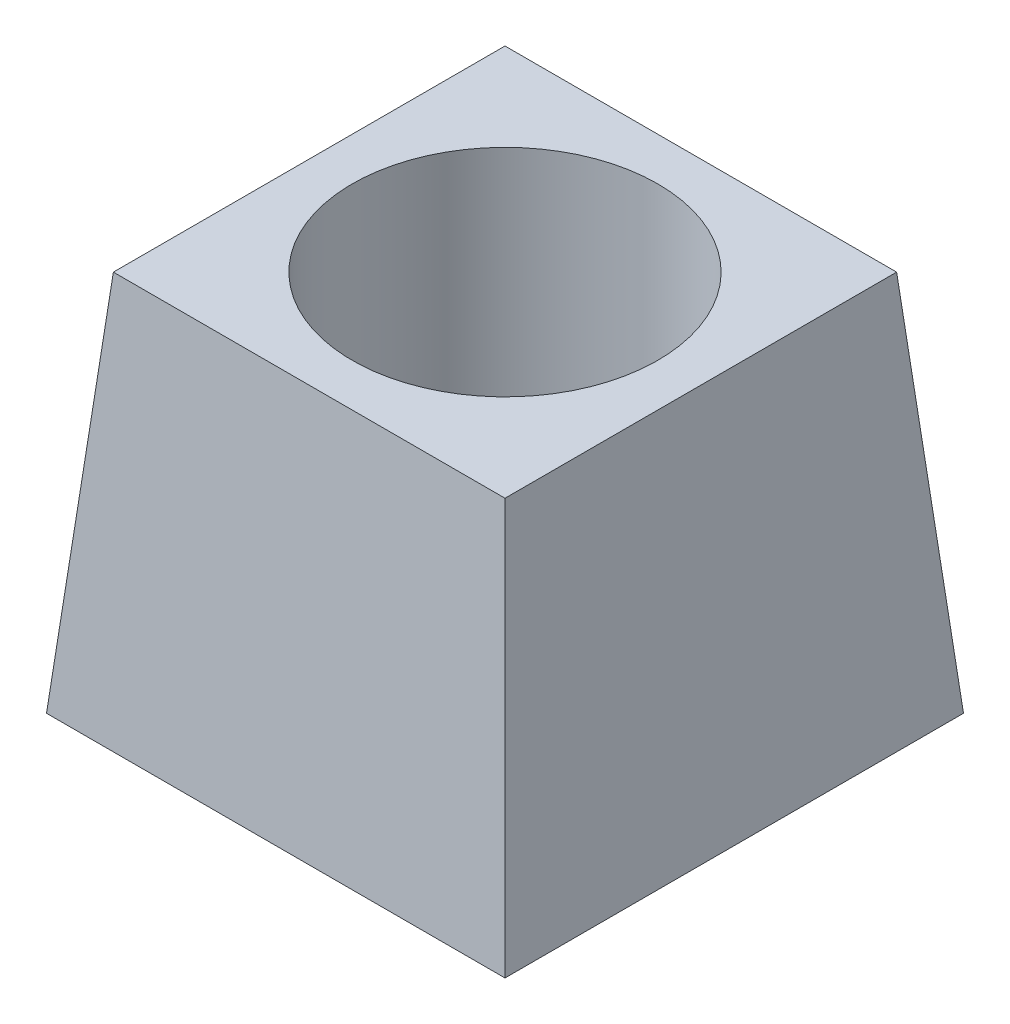
ISO-10303-21;
HEADER;
FILE_DESCRIPTION(('STEP AP214'),'2;1');
FILE_NAME('part.step','',(''),(''),'','','');
FILE_SCHEMA(('AUTOMOTIVE_DESIGN { 1 0 10303 214 1 1 1 1 }'));
ENDSEC;
DATA;
#1=APPLICATION_CONTEXT('core data for automotive mechanical design processes');
#2=APPLICATION_PROTOCOL_DEFINITION('international standard','automotive_design',2000,#1);
#3=PRODUCT_CONTEXT('',#1,'mechanical');
#4=PRODUCT('Part','Part','',(#3));
#5=PRODUCT_RELATED_PRODUCT_CATEGORY('part','',(#4));
#6=PRODUCT_DEFINITION_FORMATION('','',#4);
#7=PRODUCT_DEFINITION_CONTEXT('part definition',#1,'design');
#8=PRODUCT_DEFINITION('design','',#6,#7);
#9=PRODUCT_DEFINITION_SHAPE('','',#8);
#10=(LENGTH_UNIT() NAMED_UNIT(*) SI_UNIT(.MILLI.,.METRE.));
#11=(NAMED_UNIT(*) PLANE_ANGLE_UNIT() SI_UNIT($,.RADIAN.));
#12=(NAMED_UNIT(*) SI_UNIT($,.STERADIAN.) SOLID_ANGLE_UNIT());
#13=UNCERTAINTY_MEASURE_WITH_UNIT(LENGTH_MEASURE(1.E-05),#10,'distance_accuracy_value','');
#14=(GEOMETRIC_REPRESENTATION_CONTEXT(3) GLOBAL_UNCERTAINTY_ASSIGNED_CONTEXT((#13)) GLOBAL_UNIT_ASSIGNED_CONTEXT((#10,
#11,#12)) REPRESENTATION_CONTEXT('',''));
#15=CARTESIAN_POINT('',(0.,0.,0.));
#16=DIRECTION('',(0.,0.,1.));
#17=DIRECTION('',(1.,0.,0.));
#18=AXIS2_PLACEMENT_3D('',#15,#16,#17);
#19=CARTESIAN_POINT('',(0.,0.,0.));
#20=DIRECTION('',(-0.996194698091746,0.0871557427476582,0.));
#21=DIRECTION('',(-0.0871557427476582,-0.996194698091746,0.));
#22=AXIS2_PLACEMENT_3D('',#19,#20,#21);
#23=PLANE('',#22);
#24=DIRECTION('',(0.,0.,1.));
#25=VECTOR('',#24,1.);
#26=CARTESIAN_POINT('',(0.,0.,0.));
#27=LINE('',#26,#25);
#28=CARTESIAN_POINT('',(0.,0.,-30.));
#29=VERTEX_POINT('',#28);
#30=CARTESIAN_POINT('',(0.,0.,0.));
#31=VERTEX_POINT('',#30);
#32=EDGE_CURVE('E79',#29,#31,#27,.T.);
#33=ORIENTED_EDGE('',*,*,#32,.T.);
#34=DIRECTION('',(-0.0868265938642476,-0.992432509138967,0.0868265938642476));
#35=VECTOR('',#34,1.);
#36=CARTESIAN_POINT('',(0.,0.,0.));
#37=LINE('',#36,#35);
#38=CARTESIAN_POINT('',(2.1872165881481,25.,-2.1872165881481));
#39=VERTEX_POINT('',#38);
#40=EDGE_CURVE('E11',#39,#31,#37,.T.);
#41=ORIENTED_EDGE('',*,*,#40,.F.);
#42=DIRECTION('',(0.,0.,-1.));
#43=VECTOR('',#42,1.);
#44=CARTESIAN_POINT('',(2.1872165881481,25.,-30.));
#45=LINE('',#44,#43);
#46=CARTESIAN_POINT('',(2.1872165881481,25.,-27.8127834118519));
#47=VERTEX_POINT('',#46);
#48=EDGE_CURVE('E100',#47,#39,#45,.F.);
#49=ORIENTED_EDGE('',*,*,#48,.F.);
#50=DIRECTION('',(-0.0868265938642476,-0.992432509138967,-0.0868265938642476));
#51=VECTOR('',#50,1.);
#52=CARTESIAN_POINT('',(0.22616572206201,2.58508603226056,-29.773834277938));
#53=LINE('',#52,#51);
#54=EDGE_CURVE('E90',#47,#29,#53,.T.);
#55=ORIENTED_EDGE('',*,*,#54,.T.);
#56=EDGE_LOOP('',(#33,#41,#49,#55));
#57=FACE_BOUND('',#56,.T.);
#58=ADVANCED_FACE('F33',(#57),#23,.T.);
#59=CARTESIAN_POINT('',(0.,0.,0.));
#60=DIRECTION('',(0.,0.0871557427476582,0.996194698091746));
#61=DIRECTION('',(0.,-0.996194698091746,0.0871557427476582));
#62=AXIS2_PLACEMENT_3D('',#59,#60,#61);
#63=PLANE('',#62);
#64=DIRECTION('',(1.,0.,0.));
#65=VECTOR('',#64,1.);
#66=CARTESIAN_POINT('',(0.,0.,0.));
#67=LINE('',#66,#65);
#68=CARTESIAN_POINT('',(30.,0.,0.));
#69=VERTEX_POINT('',#68);
#70=EDGE_CURVE('E75',#31,#69,#67,.T.);
#71=ORIENTED_EDGE('',*,*,#70,.T.);
#72=DIRECTION('',(0.0868265938642476,-0.992432509138967,0.0868265938642476));
#73=VECTOR('',#72,1.);
#74=CARTESIAN_POINT('',(30.,0.,0.));
#75=LINE('',#74,#73);
#76=CARTESIAN_POINT('',(27.8127834118519,25.,-2.1872165881481));
#77=VERTEX_POINT('',#76);
#78=EDGE_CURVE('E42',#77,#69,#75,.T.);
#79=ORIENTED_EDGE('',*,*,#78,.F.);
#80=DIRECTION('',(-1.,0.,0.));
#81=VECTOR('',#80,1.);
#82=CARTESIAN_POINT('',(0.,25.,-2.1872165881481));
#83=LINE('',#82,#81);
#84=EDGE_CURVE('E86',#39,#77,#83,.F.);
#85=ORIENTED_EDGE('',*,*,#84,.F.);
#86=ORIENTED_EDGE('',*,*,#40,.T.);
#87=EDGE_LOOP('',(#71,#79,#85,#86));
#88=FACE_BOUND('',#87,.T.);
#89=ADVANCED_FACE('F35',(#88),#63,.T.);
#90=CARTESIAN_POINT('',(30.,0.,0.));
#91=DIRECTION('',(0.996194698091746,0.0871557427476582,0.));
#92=DIRECTION('',(-0.0871557427476582,0.996194698091746,0.));
#93=AXIS2_PLACEMENT_3D('',#90,#91,#92);
#94=PLANE('',#93);
#95=DIRECTION('',(0.,0.,-1.));
#96=VECTOR('',#95,1.);
#97=CARTESIAN_POINT('',(30.,0.,0.));
#98=LINE('',#97,#96);
#99=CARTESIAN_POINT('',(30.,0.,-30.));
#100=VERTEX_POINT('',#99);
#101=EDGE_CURVE('E80',#69,#100,#98,.T.);
#102=ORIENTED_EDGE('',*,*,#101,.T.);
#103=DIRECTION('',(0.0868265938642476,-0.992432509138967,-0.0868265938642476));
#104=VECTOR('',#103,1.);
#105=CARTESIAN_POINT('',(29.773834277938,2.58508603226056,-29.773834277938));
#106=LINE('',#105,#104);
#107=CARTESIAN_POINT('',(27.8127834118519,25.,-27.8127834118519));
#108=VERTEX_POINT('',#107);
#109=EDGE_CURVE('E103',#108,#100,#106,.T.);
#110=ORIENTED_EDGE('',*,*,#109,.F.);
#111=DIRECTION('',(0.,0.,1.));
#112=VECTOR('',#111,1.);
#113=CARTESIAN_POINT('',(27.8127834118519,25.,-30.));
#114=LINE('',#113,#112);
#115=EDGE_CURVE('E54',#77,#108,#114,.F.);
#116=ORIENTED_EDGE('',*,*,#115,.F.);
#117=ORIENTED_EDGE('',*,*,#78,.T.);
#118=EDGE_LOOP('',(#102,#110,#116,#117));
#119=FACE_BOUND('',#118,.T.);
#120=ADVANCED_FACE('F110',(#119),#94,.T.);
#121=CARTESIAN_POINT('',(0.,0.,-30.));
#122=DIRECTION('',(0.,0.0871557427476582,-0.996194698091746));
#123=DIRECTION('',(0.,0.996194698091746,0.0871557427476582));
#124=AXIS2_PLACEMENT_3D('',#121,#122,#123);
#125=PLANE('',#124);
#126=DIRECTION('',(-1.,0.,0.));
#127=VECTOR('',#126,1.);
#128=CARTESIAN_POINT('',(0.,0.,-30.));
#129=LINE('',#128,#127);
#130=EDGE_CURVE('E99',#100,#29,#129,.T.);
#131=ORIENTED_EDGE('',*,*,#130,.T.);
#132=ORIENTED_EDGE('',*,*,#54,.F.);
#133=DIRECTION('',(1.,0.,0.));
#134=VECTOR('',#133,1.);
#135=CARTESIAN_POINT('',(0.,25.,-27.8127834118519));
#136=LINE('',#135,#134);
#137=EDGE_CURVE('E37',#108,#47,#136,.F.);
#138=ORIENTED_EDGE('',*,*,#137,.F.);
#139=ORIENTED_EDGE('',*,*,#109,.T.);
#140=EDGE_LOOP('',(#131,#132,#138,#139));
#141=FACE_BOUND('',#140,.T.);
#142=ADVANCED_FACE('F112',(#141),#125,.T.);
#143=CARTESIAN_POINT('',(0.,25.,-30.));
#144=DIRECTION('',(0.,-1.,0.));
#145=DIRECTION('',(0.,0.,-1.));
#146=AXIS2_PLACEMENT_3D('',#143,#144,#145);
#147=PLANE('',#146);
#148=CARTESIAN_POINT('',(15.,25.,-15.));
#149=DIRECTION('',(0.,-1.,0.));
#150=DIRECTION('',(0.,0.,-1.));
#151=AXIS2_PLACEMENT_3D('',#148,#149,#150);
#152=CIRCLE('',#151,10.);
#153=CARTESIAN_POINT('',(15.,25.,-25.));
#154=VERTEX_POINT('',#153);
#155=EDGE_CURVE('E91',#154,#154,#152,.T.);
#156=ORIENTED_EDGE('',*,*,#155,.T.);
#157=EDGE_LOOP('',(#156));
#158=FACE_BOUND('',#157,.T.);
#159=ORIENTED_EDGE('',*,*,#48,.T.);
#160=ORIENTED_EDGE('',*,*,#84,.T.);
#161=ORIENTED_EDGE('',*,*,#115,.T.);
#162=ORIENTED_EDGE('',*,*,#137,.T.);
#163=EDGE_LOOP('',(#159,#160,#161,#162));
#164=FACE_BOUND('',#163,.T.);
#165=ADVANCED_FACE('F108',(#158,#164),#147,.F.);
#166=CARTESIAN_POINT('',(0.,0.,-30.));
#167=DIRECTION('',(0.,-1.,0.));
#168=DIRECTION('',(0.,0.,-1.));
#169=AXIS2_PLACEMENT_3D('',#166,#167,#168);
#170=PLANE('',#169);
#171=CARTESIAN_POINT('',(15.,0.,-15.));
#172=DIRECTION('',(0.,-1.,0.));
#173=DIRECTION('',(0.,0.,-1.));
#174=AXIS2_PLACEMENT_3D('',#171,#172,#173);
#175=CIRCLE('',#174,10.);
#176=CARTESIAN_POINT('',(15.,0.,-25.));
#177=VERTEX_POINT('',#176);
#178=EDGE_CURVE('E94',#177,#177,#175,.T.);
#179=ORIENTED_EDGE('',*,*,#178,.F.);
#180=EDGE_LOOP('',(#179));
#181=FACE_BOUND('',#180,.T.);
#182=ORIENTED_EDGE('',*,*,#32,.F.);
#183=ORIENTED_EDGE('',*,*,#130,.F.);
#184=ORIENTED_EDGE('',*,*,#101,.F.);
#185=ORIENTED_EDGE('',*,*,#70,.F.);
#186=EDGE_LOOP('',(#182,#183,#184,#185));
#187=FACE_BOUND('',#186,.T.);
#188=ADVANCED_FACE('F76',(#181,#187),#170,.T.);
#189=CARTESIAN_POINT('',(15.,25.,-15.));
#190=DIRECTION('',(0.,-1.,0.));
#191=DIRECTION('',(0.,0.,-1.));
#192=AXIS2_PLACEMENT_3D('',#189,#190,#191);
#193=CYLINDRICAL_SURFACE('',#192,10.);
#194=ORIENTED_EDGE('',*,*,#155,.F.);
#195=EDGE_LOOP('',(#194));
#196=FACE_BOUND('',#195,.T.);
#197=ORIENTED_EDGE('',*,*,#178,.T.);
#198=EDGE_LOOP('',(#197));
#199=FACE_BOUND('',#198,.T.);
#200=ADVANCED_FACE('F128',(#196,#199),#193,.F.);
#201=CLOSED_SHELL('',(#58,#89,#120,#142,#165,#188,#200));
#202=MANIFOLD_SOLID_BREP('B2',#201);
#203=ADVANCED_BREP_SHAPE_REPRESENTATION('',(#18,#202),#14);
#204=SHAPE_DEFINITION_REPRESENTATION(#9,#203);
ENDSEC;
END-ISO-10303-21;
